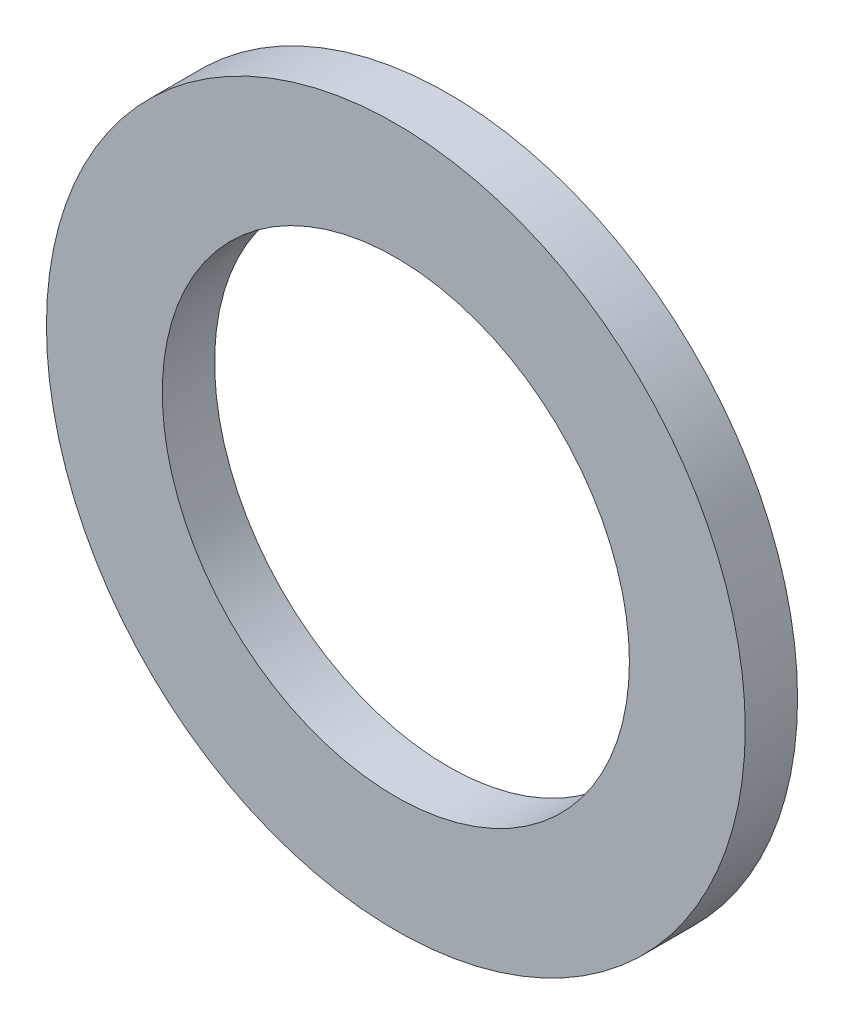
ISO-10303-21;
HEADER;
FILE_DESCRIPTION(('STEP AP214'),'2;1');
FILE_NAME('part.step','',(''),(''),'','','');
FILE_SCHEMA(('AUTOMOTIVE_DESIGN { 1 0 10303 214 1 1 1 1 }'));
ENDSEC;
DATA;
#1=APPLICATION_CONTEXT('core data for automotive mechanical design processes');
#2=APPLICATION_PROTOCOL_DEFINITION('international standard','automotive_design',2000,#1);
#3=PRODUCT_CONTEXT('',#1,'mechanical');
#4=PRODUCT('Part','Part','',(#3));
#5=PRODUCT_RELATED_PRODUCT_CATEGORY('part','',(#4));
#6=PRODUCT_DEFINITION_FORMATION('','',#4);
#7=PRODUCT_DEFINITION_CONTEXT('part definition',#1,'design');
#8=PRODUCT_DEFINITION('design','',#6,#7);
#9=PRODUCT_DEFINITION_SHAPE('','',#8);
#10=(LENGTH_UNIT() NAMED_UNIT(*) SI_UNIT(.MILLI.,.METRE.));
#11=(NAMED_UNIT(*) PLANE_ANGLE_UNIT() SI_UNIT($,.RADIAN.));
#12=(NAMED_UNIT(*) SI_UNIT($,.STERADIAN.) SOLID_ANGLE_UNIT());
#13=UNCERTAINTY_MEASURE_WITH_UNIT(LENGTH_MEASURE(1.E-05),#10,'distance_accuracy_value','');
#14=(GEOMETRIC_REPRESENTATION_CONTEXT(3) GLOBAL_UNCERTAINTY_ASSIGNED_CONTEXT((#13)) GLOBAL_UNIT_ASSIGNED_CONTEXT((#10,
#11,#12)) REPRESENTATION_CONTEXT('',''));
#15=CARTESIAN_POINT('',(0.,0.,0.));
#16=DIRECTION('',(0.,0.,1.));
#17=DIRECTION('',(1.,0.,0.));
#18=AXIS2_PLACEMENT_3D('',#15,#16,#17);
#19=CARTESIAN_POINT('',(0.,0.,0.3556));
#20=DIRECTION('',(0.,0.,1.));
#21=DIRECTION('',(1.,0.,0.));
#22=AXIS2_PLACEMENT_3D('',#19,#20,#21);
#23=PLANE('',#22);
#24=CARTESIAN_POINT('',(0.,0.,0.3556));
#25=DIRECTION('',(0.,0.,1.));
#26=DIRECTION('',(1.,0.,0.));
#27=AXIS2_PLACEMENT_3D('',#24,#25,#26);
#28=CIRCLE('',#27,2.3749);
#29=CARTESIAN_POINT('',(2.3749,0.,0.3556));
#30=VERTEX_POINT('',#29);
#31=EDGE_CURVE('E10',#30,#30,#28,.T.);
#32=ORIENTED_EDGE('',*,*,#31,.T.);
#33=EDGE_LOOP('',(#32));
#34=FACE_BOUND('',#33,.T.);
#35=CARTESIAN_POINT('',(0.,0.,0.3556));
#36=DIRECTION('',(0.,0.,1.));
#37=DIRECTION('',(1.,0.,0.));
#38=AXIS2_PLACEMENT_3D('',#35,#36,#37);
#39=CIRCLE('',#38,1.5875);
#40=CARTESIAN_POINT('',(1.5875,0.,0.3556));
#41=VERTEX_POINT('',#40);
#42=EDGE_CURVE('E42',#41,#41,#39,.T.);
#43=ORIENTED_EDGE('',*,*,#42,.F.);
#44=EDGE_LOOP('',(#43));
#45=FACE_BOUND('',#44,.T.);
#46=ADVANCED_FACE('F31',(#34,#45),#23,.T.);
#47=CARTESIAN_POINT('',(0.,0.,0.));
#48=DIRECTION('',(0.,0.,1.));
#49=DIRECTION('',(1.,0.,0.));
#50=AXIS2_PLACEMENT_3D('',#47,#48,#49);
#51=PLANE('',#50);
#52=CARTESIAN_POINT('',(0.,0.,0.));
#53=DIRECTION('',(0.,0.,1.));
#54=DIRECTION('',(1.,0.,0.));
#55=AXIS2_PLACEMENT_3D('',#52,#53,#54);
#56=CIRCLE('',#55,2.3749);
#57=CARTESIAN_POINT('',(2.3749,0.,0.));
#58=VERTEX_POINT('',#57);
#59=EDGE_CURVE('E35',#58,#58,#56,.T.);
#60=ORIENTED_EDGE('',*,*,#59,.F.);
#61=EDGE_LOOP('',(#60));
#62=FACE_BOUND('',#61,.T.);
#63=CARTESIAN_POINT('',(0.,0.,0.));
#64=DIRECTION('',(0.,0.,1.));
#65=DIRECTION('',(1.,0.,0.));
#66=AXIS2_PLACEMENT_3D('',#63,#64,#65);
#67=CIRCLE('',#66,1.5875);
#68=CARTESIAN_POINT('',(1.5875,0.,0.));
#69=VERTEX_POINT('',#68);
#70=EDGE_CURVE('E44',#69,#69,#67,.T.);
#71=ORIENTED_EDGE('',*,*,#70,.T.);
#72=EDGE_LOOP('',(#71));
#73=FACE_BOUND('',#72,.T.);
#74=ADVANCED_FACE('F54',(#62,#73),#51,.F.);
#75=CARTESIAN_POINT('',(0.,0.,0.3556));
#76=DIRECTION('',(0.,0.,-1.));
#77=DIRECTION('',(-1.,0.,0.));
#78=AXIS2_PLACEMENT_3D('',#75,#76,#77);
#79=CYLINDRICAL_SURFACE('',#78,2.3749);
#80=ORIENTED_EDGE('',*,*,#31,.F.);
#81=EDGE_LOOP('',(#80));
#82=FACE_BOUND('',#81,.T.);
#83=ORIENTED_EDGE('',*,*,#59,.T.);
#84=EDGE_LOOP('',(#83));
#85=FACE_BOUND('',#84,.T.);
#86=ADVANCED_FACE('F33',(#82,#85),#79,.T.);
#87=CARTESIAN_POINT('',(0.,0.,0.3556));
#88=DIRECTION('',(0.,0.,-1.));
#89=DIRECTION('',(-1.,0.,0.));
#90=AXIS2_PLACEMENT_3D('',#87,#88,#89);
#91=CYLINDRICAL_SURFACE('',#90,1.5875);
#92=ORIENTED_EDGE('',*,*,#42,.T.);
#93=EDGE_LOOP('',(#92));
#94=FACE_BOUND('',#93,.T.);
#95=ORIENTED_EDGE('',*,*,#70,.F.);
#96=EDGE_LOOP('',(#95));
#97=FACE_BOUND('',#96,.T.);
#98=ADVANCED_FACE('F50',(#94,#97),#91,.F.);
#99=CLOSED_SHELL('',(#46,#74,#86,#98));
#100=MANIFOLD_SOLID_BREP('B2',#99);
#101=ADVANCED_BREP_SHAPE_REPRESENTATION('',(#18,#100),#14);
#102=SHAPE_DEFINITION_REPRESENTATION(#9,#101);
ENDSEC;
END-ISO-10303-21;
